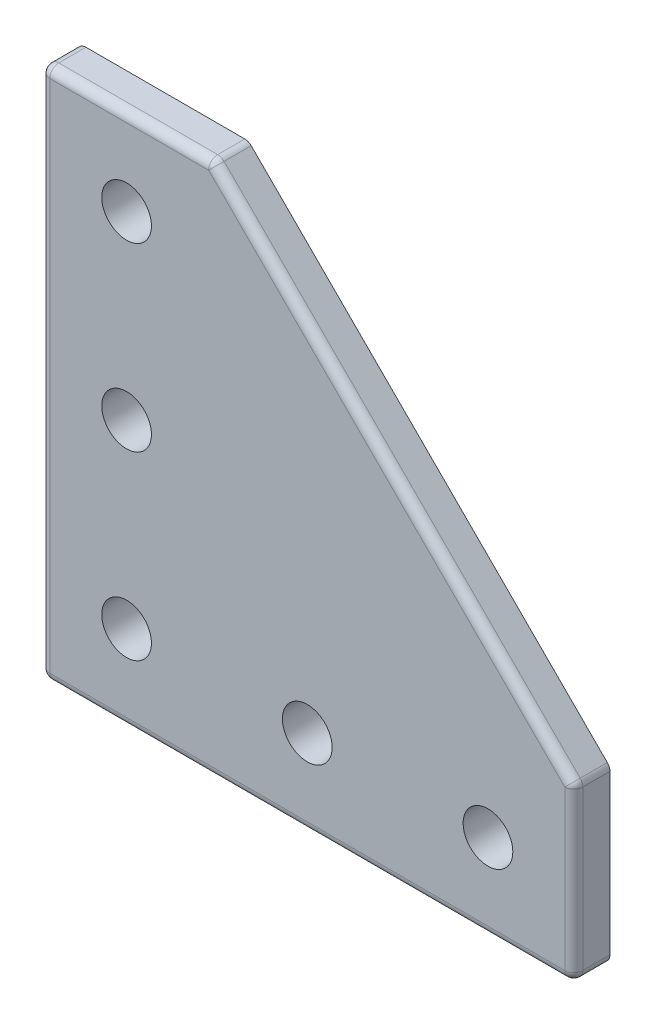
ISO-10303-21;
HEADER;
FILE_DESCRIPTION(('STEP AP214'),'2;1');
FILE_NAME('part.step','',(''),(''),'','','');
FILE_SCHEMA(('AUTOMOTIVE_DESIGN { 1 0 10303 214 1 1 1 1 }'));
ENDSEC;
DATA;
#1=APPLICATION_CONTEXT('core data for automotive mechanical design processes');
#2=APPLICATION_PROTOCOL_DEFINITION('international standard','automotive_design',2000,#1);
#3=PRODUCT_CONTEXT('',#1,'mechanical');
#4=PRODUCT('Part','Part','',(#3));
#5=PRODUCT_RELATED_PRODUCT_CATEGORY('part','',(#4));
#6=PRODUCT_DEFINITION_FORMATION('','',#4);
#7=PRODUCT_DEFINITION_CONTEXT('part definition',#1,'design');
#8=PRODUCT_DEFINITION('design','',#6,#7);
#9=PRODUCT_DEFINITION_SHAPE('','',#8);
#10=(LENGTH_UNIT() NAMED_UNIT(*) SI_UNIT(.MILLI.,.METRE.));
#11=(NAMED_UNIT(*) PLANE_ANGLE_UNIT() SI_UNIT($,.RADIAN.));
#12=(NAMED_UNIT(*) SI_UNIT($,.STERADIAN.) SOLID_ANGLE_UNIT());
#13=UNCERTAINTY_MEASURE_WITH_UNIT(LENGTH_MEASURE(1.E-05),#10,'distance_accuracy_value','');
#14=(GEOMETRIC_REPRESENTATION_CONTEXT(3) GLOBAL_UNCERTAINTY_ASSIGNED_CONTEXT((#13)) GLOBAL_UNIT_ASSIGNED_CONTEXT((#10,
#11,#12)) REPRESENTATION_CONTEXT('',''));
#15=CARTESIAN_POINT('',(0.,0.,0.));
#16=DIRECTION('',(0.,0.,1.));
#17=DIRECTION('',(1.,0.,0.));
#18=AXIS2_PLACEMENT_3D('',#15,#16,#17);
#19=CARTESIAN_POINT('',(0.,0.,2.));
#20=DIRECTION('',(0.,0.,-1.));
#21=DIRECTION('',(-1.,0.,0.));
#22=AXIS2_PLACEMENT_3D('',#19,#20,#21);
#23=PLANE('',#22);
#24=DIRECTION('',(0.,-1.,0.));
#25=VECTOR('',#24,1.);
#26=CARTESIAN_POINT('',(1.,0.,2.));
#27=LINE('',#26,#25);
#28=CARTESIAN_POINT('',(1.,58.,2.));
#29=VERTEX_POINT('',#28);
#30=CARTESIAN_POINT('',(1.,1.,2.));
#31=VERTEX_POINT('',#30);
#32=EDGE_CURVE('E1163',#29,#31,#27,.T.);
#33=ORIENTED_EDGE('',*,*,#32,.T.);
#34=DIRECTION('',(1.,0.,0.));
#35=VECTOR('',#34,1.);
#36=CARTESIAN_POINT('',(0.,1.,2.));
#37=LINE('',#36,#35);
#38=CARTESIAN_POINT('',(58.,0.999999999999998,2.));
#39=VERTEX_POINT('',#38);
#40=EDGE_CURVE('E1170',#31,#39,#37,.T.);
#41=ORIENTED_EDGE('',*,*,#40,.T.);
#42=DIRECTION('',(0.,1.,0.));
#43=VECTOR('',#42,1.);
#44=CARTESIAN_POINT('',(58.,0.,2.));
#45=LINE('',#44,#43);
#46=CARTESIAN_POINT('',(58.,18.5857864376269,2.));
#47=VERTEX_POINT('',#46);
#48=EDGE_CURVE('E1168',#39,#47,#45,.T.);
#49=ORIENTED_EDGE('',*,*,#48,.T.);
#50=DIRECTION('',(-0.707106781186547,0.707106781186548,0.));
#51=VECTOR('',#50,1.);
#52=CARTESIAN_POINT('',(38.2928932188135,38.2928932188134,2.));
#53=LINE('',#52,#51);
#54=CARTESIAN_POINT('',(18.5857864376269,58.,2.));
#55=VERTEX_POINT('',#54);
#56=EDGE_CURVE('E1165',#47,#55,#53,.T.);
#57=ORIENTED_EDGE('',*,*,#56,.T.);
#58=DIRECTION('',(-1.,0.,0.));
#59=VECTOR('',#58,1.);
#60=CARTESIAN_POINT('',(0.,58.,2.));
#61=LINE('',#60,#59);
#62=EDGE_CURVE('E1161',#55,#29,#61,.T.);
#63=ORIENTED_EDGE('',*,*,#62,.T.);
#64=EDGE_LOOP('',(#33,#41,#49,#57,#63));
#65=FACE_BOUND('',#64,.T.);
#66=CARTESIAN_POINT('',(9.5,29.5,2.));
#67=DIRECTION('',(0.,0.,1.));
#68=DIRECTION('',(1.,0.,0.));
#69=AXIS2_PLACEMENT_3D('',#66,#67,#68);
#70=CIRCLE('',#69,2.75000000000001);
#71=CARTESIAN_POINT('',(12.25,29.5,2.));
#72=VERTEX_POINT('',#71);
#73=EDGE_CURVE('E1240',#72,#72,#70,.T.);
#74=ORIENTED_EDGE('',*,*,#73,.F.);
#75=EDGE_LOOP('',(#74));
#76=FACE_BOUND('',#75,.T.);
#77=CARTESIAN_POINT('',(29.5,9.49999999999999,2.));
#78=DIRECTION('',(0.,0.,1.));
#79=DIRECTION('',(1.,0.,0.));
#80=AXIS2_PLACEMENT_3D('',#77,#78,#79);
#81=CIRCLE('',#80,2.75);
#82=CARTESIAN_POINT('',(32.25,9.49999999999999,2.));
#83=VERTEX_POINT('',#82);
#84=EDGE_CURVE('E1252',#83,#83,#81,.T.);
#85=ORIENTED_EDGE('',*,*,#84,.F.);
#86=EDGE_LOOP('',(#85));
#87=FACE_BOUND('',#86,.T.);
#88=CARTESIAN_POINT('',(9.5,9.49999999999999,2.));
#89=DIRECTION('',(0.,0.,1.));
#90=DIRECTION('',(1.,0.,0.));
#91=AXIS2_PLACEMENT_3D('',#88,#89,#90);
#92=CIRCLE('',#91,2.75);
#93=CARTESIAN_POINT('',(12.25,9.49999999999999,2.));
#94=VERTEX_POINT('',#93);
#95=EDGE_CURVE('E1258',#94,#94,#92,.T.);
#96=ORIENTED_EDGE('',*,*,#95,.F.);
#97=EDGE_LOOP('',(#96));
#98=FACE_BOUND('',#97,.T.);
#99=CARTESIAN_POINT('',(49.5,9.49999999999999,2.));
#100=DIRECTION('',(0.,0.,1.));
#101=DIRECTION('',(1.,0.,0.));
#102=AXIS2_PLACEMENT_3D('',#99,#100,#101);
#103=CIRCLE('',#102,2.75000000000001);
#104=CARTESIAN_POINT('',(52.25,9.49999999999999,2.));
#105=VERTEX_POINT('',#104);
#106=EDGE_CURVE('E1246',#105,#105,#103,.T.);
#107=ORIENTED_EDGE('',*,*,#106,.F.);
#108=EDGE_LOOP('',(#107));
#109=FACE_BOUND('',#108,.T.);
#110=CARTESIAN_POINT('',(9.5,49.5,2.));
#111=DIRECTION('',(0.,0.,1.));
#112=DIRECTION('',(1.,0.,0.));
#113=AXIS2_PLACEMENT_3D('',#110,#111,#112);
#114=CIRCLE('',#113,2.75);
#115=CARTESIAN_POINT('',(12.25,49.5,2.));
#116=VERTEX_POINT('',#115);
#117=EDGE_CURVE('E1232',#116,#116,#114,.T.);
#118=ORIENTED_EDGE('',*,*,#117,.F.);
#119=EDGE_LOOP('',(#118));
#120=FACE_BOUND('',#119,.T.);
#121=ADVANCED_FACE('F1020',(#65,#76,#87,#98,#109,#120),#23,.F.);
#122=CARTESIAN_POINT('',(0.,0.,-2.));
#123=DIRECTION('',(0.,0.,-1.));
#124=DIRECTION('',(-1.,0.,0.));
#125=AXIS2_PLACEMENT_3D('',#122,#123,#124);
#126=PLANE('',#125);
#127=CARTESIAN_POINT('',(9.5,29.5,-2.));
#128=DIRECTION('',(0.,0.,1.));
#129=DIRECTION('',(1.,0.,0.));
#130=AXIS2_PLACEMENT_3D('',#127,#128,#129);
#131=CIRCLE('',#130,2.75000000000001);
#132=CARTESIAN_POINT('',(12.25,29.5,-2.));
#133=VERTEX_POINT('',#132);
#134=EDGE_CURVE('E1237',#133,#133,#131,.T.);
#135=ORIENTED_EDGE('',*,*,#134,.T.);
#136=EDGE_LOOP('',(#135));
#137=FACE_BOUND('',#136,.T.);
#138=CARTESIAN_POINT('',(29.5,9.49999999999999,-2.));
#139=DIRECTION('',(0.,0.,1.));
#140=DIRECTION('',(1.,0.,0.));
#141=AXIS2_PLACEMENT_3D('',#138,#139,#140);
#142=CIRCLE('',#141,2.75);
#143=CARTESIAN_POINT('',(32.25,9.49999999999999,-2.));
#144=VERTEX_POINT('',#143);
#145=EDGE_CURVE('E1249',#144,#144,#142,.T.);
#146=ORIENTED_EDGE('',*,*,#145,.T.);
#147=EDGE_LOOP('',(#146));
#148=FACE_BOUND('',#147,.T.);
#149=DIRECTION('',(-0.707106781186547,0.707106781186548,0.));
#150=VECTOR('',#149,1.);
#151=CARTESIAN_POINT('',(19.,59.,-2.));
#152=LINE('',#151,#150);
#153=CARTESIAN_POINT('',(58.7071067811865,19.2928932188134,-2.));
#154=VERTEX_POINT('',#153);
#155=CARTESIAN_POINT('',(19.2928932188135,58.7071067811865,-2.));
#156=VERTEX_POINT('',#155);
#157=EDGE_CURVE('E1126',#154,#156,#152,.T.);
#158=ORIENTED_EDGE('',*,*,#157,.F.);
#159=CARTESIAN_POINT('',(58.,18.5857864376269,-2.));
#160=DIRECTION('',(0.,0.,-1.));
#161=DIRECTION('',(-1.,0.,0.));
#162=AXIS2_PLACEMENT_3D('',#159,#160,#161);
#163=CIRCLE('',#162,1.);
#164=CARTESIAN_POINT('',(59.,18.5857864376269,-2.));
#165=VERTEX_POINT('',#164);
#166=EDGE_CURVE('E1110',#154,#165,#163,.T.);
#167=ORIENTED_EDGE('',*,*,#166,.T.);
#168=DIRECTION('',(0.,1.,0.));
#169=VECTOR('',#168,1.);
#170=CARTESIAN_POINT('',(59.,19.,-2.));
#171=LINE('',#170,#169);
#172=CARTESIAN_POINT('',(59.,0.999999999999997,-2.));
#173=VERTEX_POINT('',#172);
#174=EDGE_CURVE('E1138',#173,#165,#171,.T.);
#175=ORIENTED_EDGE('',*,*,#174,.F.);
#176=CARTESIAN_POINT('',(58.,0.999999999999997,-2.));
#177=DIRECTION('',(0.,0.,-1.));
#178=DIRECTION('',(-1.,0.,0.));
#179=AXIS2_PLACEMENT_3D('',#176,#177,#178);
#180=CIRCLE('',#179,1.);
#181=CARTESIAN_POINT('',(58.,0.,-2.));
#182=VERTEX_POINT('',#181);
#183=EDGE_CURVE('E1152',#173,#182,#180,.T.);
#184=ORIENTED_EDGE('',*,*,#183,.T.);
#185=DIRECTION('',(1.,0.,0.));
#186=VECTOR('',#185,1.);
#187=CARTESIAN_POINT('',(59.,0.,-2.));
#188=LINE('',#187,#186);
#189=CARTESIAN_POINT('',(1.,0.,-2.));
#190=VERTEX_POINT('',#189);
#191=EDGE_CURVE('E1143',#190,#182,#188,.T.);
#192=ORIENTED_EDGE('',*,*,#191,.F.);
#193=CARTESIAN_POINT('',(1.,1.,-2.));
#194=DIRECTION('',(0.,0.,-1.));
#195=DIRECTION('',(-1.,0.,0.));
#196=AXIS2_PLACEMENT_3D('',#193,#194,#195);
#197=CIRCLE('',#196,1.);
#198=CARTESIAN_POINT('',(0.,1.,-2.));
#199=VERTEX_POINT('',#198);
#200=EDGE_CURVE('E1154',#190,#199,#197,.T.);
#201=ORIENTED_EDGE('',*,*,#200,.T.);
#202=DIRECTION('',(0.,-1.,0.));
#203=VECTOR('',#202,1.);
#204=CARTESIAN_POINT('',(0.,0.,-2.));
#205=LINE('',#204,#203);
#206=CARTESIAN_POINT('',(0.,58.,-2.));
#207=VERTEX_POINT('',#206);
#208=EDGE_CURVE('E1141',#207,#199,#205,.T.);
#209=ORIENTED_EDGE('',*,*,#208,.F.);
#210=CARTESIAN_POINT('',(1.,58.,-2.));
#211=DIRECTION('',(0.,0.,-1.));
#212=DIRECTION('',(-1.,0.,0.));
#213=AXIS2_PLACEMENT_3D('',#210,#211,#212);
#214=CIRCLE('',#213,1.);
#215=CARTESIAN_POINT('',(1.,59.,-2.));
#216=VERTEX_POINT('',#215);
#217=EDGE_CURVE('E1131',#207,#216,#214,.T.);
#218=ORIENTED_EDGE('',*,*,#217,.T.);
#219=DIRECTION('',(-1.,0.,0.));
#220=VECTOR('',#219,1.);
#221=CARTESIAN_POINT('',(19.,59.,-2.));
#222=LINE('',#221,#220);
#223=CARTESIAN_POINT('',(18.5857864376269,59.,-2.));
#224=VERTEX_POINT('',#223);
#225=EDGE_CURVE('E1137',#224,#216,#222,.T.);
#226=ORIENTED_EDGE('',*,*,#225,.F.);
#227=CARTESIAN_POINT('',(18.5857864376269,58.,-2.));
#228=DIRECTION('',(0.,0.,-1.));
#229=DIRECTION('',(-1.,0.,0.));
#230=AXIS2_PLACEMENT_3D('',#227,#228,#229);
#231=CIRCLE('',#230,1.);
#232=EDGE_CURVE('E1121',#224,#156,#231,.T.);
#233=ORIENTED_EDGE('',*,*,#232,.T.);
#234=EDGE_LOOP('',(#158,#167,#175,#184,#192,#201,#209,#218,#226,#233));
#235=FACE_BOUND('',#234,.T.);
#236=CARTESIAN_POINT('',(9.5,9.49999999999999,-2.));
#237=DIRECTION('',(0.,0.,1.));
#238=DIRECTION('',(1.,0.,0.));
#239=AXIS2_PLACEMENT_3D('',#236,#237,#238);
#240=CIRCLE('',#239,2.75);
#241=CARTESIAN_POINT('',(12.25,9.49999999999999,-2.));
#242=VERTEX_POINT('',#241);
#243=EDGE_CURVE('E1255',#242,#242,#240,.T.);
#244=ORIENTED_EDGE('',*,*,#243,.T.);
#245=EDGE_LOOP('',(#244));
#246=FACE_BOUND('',#245,.T.);
#247=CARTESIAN_POINT('',(49.5,9.49999999999999,-2.));
#248=DIRECTION('',(0.,0.,1.));
#249=DIRECTION('',(1.,0.,0.));
#250=AXIS2_PLACEMENT_3D('',#247,#248,#249);
#251=CIRCLE('',#250,2.75000000000001);
#252=CARTESIAN_POINT('',(52.25,9.49999999999999,-2.));
#253=VERTEX_POINT('',#252);
#254=EDGE_CURVE('E1243',#253,#253,#251,.T.);
#255=ORIENTED_EDGE('',*,*,#254,.T.);
#256=EDGE_LOOP('',(#255));
#257=FACE_BOUND('',#256,.T.);
#258=CARTESIAN_POINT('',(9.5,49.5,-2.));
#259=DIRECTION('',(0.,0.,1.));
#260=DIRECTION('',(1.,0.,0.));
#261=AXIS2_PLACEMENT_3D('',#258,#259,#260);
#262=CIRCLE('',#261,2.75);
#263=CARTESIAN_POINT('',(12.25,49.5,-2.));
#264=VERTEX_POINT('',#263);
#265=EDGE_CURVE('E1229',#264,#264,#262,.T.);
#266=ORIENTED_EDGE('',*,*,#265,.T.);
#267=EDGE_LOOP('',(#266));
#268=FACE_BOUND('',#267,.T.);
#269=ADVANCED_FACE('F1133',(#137,#148,#235,#246,#257,#268),#126,.T.);
#270=CARTESIAN_POINT('',(59.,0.,2.));
#271=DIRECTION('',(0.,1.,0.));
#272=DIRECTION('',(-1.,0.,0.));
#273=AXIS2_PLACEMENT_3D('',#270,#271,#272);
#274=PLANE('',#273);
#275=DIRECTION('',(1.,0.,0.));
#276=VECTOR('',#275,1.);
#277=CARTESIAN_POINT('',(59.,0.,1.));
#278=LINE('',#277,#276);
#279=CARTESIAN_POINT('',(58.,0.,1.));
#280=VERTEX_POINT('',#279);
#281=CARTESIAN_POINT('',(1.,0.,1.));
#282=VERTEX_POINT('',#281);
#283=EDGE_CURVE('E1180',#280,#282,#278,.F.);
#284=ORIENTED_EDGE('',*,*,#283,.T.);
#285=DIRECTION('',(0.,0.,-1.));
#286=VECTOR('',#285,1.);
#287=CARTESIAN_POINT('',(1.,0.,2.));
#288=LINE('',#287,#286);
#289=EDGE_CURVE('E1182',#282,#190,#288,.T.);
#290=ORIENTED_EDGE('',*,*,#289,.T.);
#291=ORIENTED_EDGE('',*,*,#191,.T.);
#292=DIRECTION('',(0.,0.,-1.));
#293=VECTOR('',#292,1.);
#294=CARTESIAN_POINT('',(58.,0.,2.));
#295=LINE('',#294,#293);
#296=EDGE_CURVE('E1178',#182,#280,#295,.F.);
#297=ORIENTED_EDGE('',*,*,#296,.T.);
#298=EDGE_LOOP('',(#284,#290,#291,#297));
#299=FACE_BOUND('',#298,.T.);
#300=ADVANCED_FACE('F1266',(#299),#274,.F.);
#301=CARTESIAN_POINT('',(59.,19.,2.));
#302=DIRECTION('',(-1.,0.,0.));
#303=DIRECTION('',(0.,0.,1.));
#304=AXIS2_PLACEMENT_3D('',#301,#302,#303);
#305=PLANE('',#304);
#306=ORIENTED_EDGE('',*,*,#174,.T.);
#307=DIRECTION('',(0.,0.,-1.));
#308=VECTOR('',#307,1.);
#309=CARTESIAN_POINT('',(59.,18.5857864376269,2.));
#310=LINE('',#309,#308);
#311=CARTESIAN_POINT('',(59.,18.5857864376269,1.));
#312=VERTEX_POINT('',#311);
#313=EDGE_CURVE('E1115',#165,#312,#310,.F.);
#314=ORIENTED_EDGE('',*,*,#313,.T.);
#315=DIRECTION('',(0.,1.,0.));
#316=VECTOR('',#315,1.);
#317=CARTESIAN_POINT('',(59.,19.,1.));
#318=LINE('',#317,#316);
#319=CARTESIAN_POINT('',(59.,0.999999999999997,1.));
#320=VERTEX_POINT('',#319);
#321=EDGE_CURVE('E1158',#312,#320,#318,.F.);
#322=ORIENTED_EDGE('',*,*,#321,.T.);
#323=DIRECTION('',(0.,0.,-1.));
#324=VECTOR('',#323,1.);
#325=CARTESIAN_POINT('',(59.,0.999999999999997,2.));
#326=LINE('',#325,#324);
#327=EDGE_CURVE('E1120',#320,#173,#326,.T.);
#328=ORIENTED_EDGE('',*,*,#327,.T.);
#329=EDGE_LOOP('',(#306,#314,#322,#328));
#330=FACE_BOUND('',#329,.T.);
#331=ADVANCED_FACE('F1323',(#330),#305,.F.);
#332=CARTESIAN_POINT('',(19.,59.,2.));
#333=DIRECTION('',(-0.707106781186548,-0.707106781186547,0.));
#334=DIRECTION('',(0.707106781186547,-0.707106781186548,0.));
#335=AXIS2_PLACEMENT_3D('',#332,#333,#334);
#336=PLANE('',#335);
#337=DIRECTION('',(-0.707106781186547,0.707106781186548,0.));
#338=VECTOR('',#337,1.);
#339=CARTESIAN_POINT('',(19.,59.,1.));
#340=LINE('',#339,#338);
#341=CARTESIAN_POINT('',(19.2928932188135,58.7071067811865,1.));
#342=VERTEX_POINT('',#341);
#343=CARTESIAN_POINT('',(58.7071067811865,19.2928932188134,1.));
#344=VERTEX_POINT('',#343);
#345=EDGE_CURVE('E1129',#342,#344,#340,.F.);
#346=ORIENTED_EDGE('',*,*,#345,.T.);
#347=DIRECTION('',(0.,0.,-1.));
#348=VECTOR('',#347,1.);
#349=CARTESIAN_POINT('',(58.7071067811865,19.2928932188134,2.));
#350=LINE('',#349,#348);
#351=EDGE_CURVE('E1114',#344,#154,#350,.T.);
#352=ORIENTED_EDGE('',*,*,#351,.T.);
#353=ORIENTED_EDGE('',*,*,#157,.T.);
#354=DIRECTION('',(0.,0.,-1.));
#355=VECTOR('',#354,1.);
#356=CARTESIAN_POINT('',(19.2928932188135,58.7071067811865,2.));
#357=LINE('',#356,#355);
#358=EDGE_CURVE('E1148',#156,#342,#357,.F.);
#359=ORIENTED_EDGE('',*,*,#358,.T.);
#360=EDGE_LOOP('',(#346,#352,#353,#359));
#361=FACE_BOUND('',#360,.T.);
#362=ADVANCED_FACE('F1125',(#361),#336,.F.);
#363=CARTESIAN_POINT('',(19.,59.,2.));
#364=DIRECTION('',(0.,-1.,0.));
#365=DIRECTION('',(0.,0.,-1.));
#366=AXIS2_PLACEMENT_3D('',#363,#364,#365);
#367=PLANE('',#366);
#368=DIRECTION('',(-1.,0.,0.));
#369=VECTOR('',#368,1.);
#370=CARTESIAN_POINT('',(19.,59.,1.));
#371=LINE('',#370,#369);
#372=CARTESIAN_POINT('',(1.,59.,1.));
#373=VERTEX_POINT('',#372);
#374=CARTESIAN_POINT('',(18.5857864376269,59.,1.));
#375=VERTEX_POINT('',#374);
#376=EDGE_CURVE('E1174',#373,#375,#371,.F.);
#377=ORIENTED_EDGE('',*,*,#376,.T.);
#378=DIRECTION('',(0.,0.,-1.));
#379=VECTOR('',#378,1.);
#380=CARTESIAN_POINT('',(18.5857864376269,59.,2.));
#381=LINE('',#380,#379);
#382=EDGE_CURVE('E1176',#375,#224,#381,.T.);
#383=ORIENTED_EDGE('',*,*,#382,.T.);
#384=ORIENTED_EDGE('',*,*,#225,.T.);
#385=DIRECTION('',(0.,0.,-1.));
#386=VECTOR('',#385,1.);
#387=CARTESIAN_POINT('',(1.,59.,2.));
#388=LINE('',#387,#386);
#389=EDGE_CURVE('E1172',#216,#373,#388,.F.);
#390=ORIENTED_EDGE('',*,*,#389,.T.);
#391=EDGE_LOOP('',(#377,#383,#384,#390));
#392=FACE_BOUND('',#391,.T.);
#393=ADVANCED_FACE('F1305',(#392),#367,.F.);
#394=CARTESIAN_POINT('',(0.,0.,2.));
#395=DIRECTION('',(1.,0.,0.));
#396=DIRECTION('',(0.,0.,-1.));
#397=AXIS2_PLACEMENT_3D('',#394,#395,#396);
#398=PLANE('',#397);
#399=ORIENTED_EDGE('',*,*,#208,.T.);
#400=DIRECTION('',(0.,0.,-1.));
#401=VECTOR('',#400,1.);
#402=CARTESIAN_POINT('',(0.,1.,2.));
#403=LINE('',#402,#401);
#404=CARTESIAN_POINT('',(0.,1.,1.));
#405=VERTEX_POINT('',#404);
#406=EDGE_CURVE('E12',#199,#405,#403,.F.);
#407=ORIENTED_EDGE('',*,*,#406,.T.);
#408=DIRECTION('',(0.,-1.,0.));
#409=VECTOR('',#408,1.);
#410=CARTESIAN_POINT('',(0.,0.,1.));
#411=LINE('',#410,#409);
#412=CARTESIAN_POINT('',(0.,58.,1.));
#413=VERTEX_POINT('',#412);
#414=EDGE_CURVE('E1029',#405,#413,#411,.F.);
#415=ORIENTED_EDGE('',*,*,#414,.T.);
#416=DIRECTION('',(0.,0.,-1.));
#417=VECTOR('',#416,1.);
#418=CARTESIAN_POINT('',(0.,58.,2.));
#419=LINE('',#418,#417);
#420=EDGE_CURVE('E1184',#413,#207,#419,.T.);
#421=ORIENTED_EDGE('',*,*,#420,.T.);
#422=EDGE_LOOP('',(#399,#407,#415,#421));
#423=FACE_BOUND('',#422,.T.);
#424=ADVANCED_FACE('F1286',(#423),#398,.F.);
#425=CARTESIAN_POINT('',(9.5,9.49999999999999,2.));
#426=DIRECTION('',(0.,0.,-1.));
#427=DIRECTION('',(-1.,0.,0.));
#428=AXIS2_PLACEMENT_3D('',#425,#426,#427);
#429=CYLINDRICAL_SURFACE('',#428,2.75);
#430=ORIENTED_EDGE('',*,*,#95,.T.);
#431=EDGE_LOOP('',(#430));
#432=FACE_BOUND('',#431,.T.);
#433=ORIENTED_EDGE('',*,*,#243,.F.);
#434=EDGE_LOOP('',(#433));
#435=FACE_BOUND('',#434,.T.);
#436=ADVANCED_FACE('F1342',(#432,#435),#429,.F.);
#437=CARTESIAN_POINT('',(29.5,9.49999999999999,2.));
#438=DIRECTION('',(0.,0.,-1.));
#439=DIRECTION('',(-1.,0.,0.));
#440=AXIS2_PLACEMENT_3D('',#437,#438,#439);
#441=CYLINDRICAL_SURFACE('',#440,2.75);
#442=ORIENTED_EDGE('',*,*,#84,.T.);
#443=EDGE_LOOP('',(#442));
#444=FACE_BOUND('',#443,.T.);
#445=ORIENTED_EDGE('',*,*,#145,.F.);
#446=EDGE_LOOP('',(#445));
#447=FACE_BOUND('',#446,.T.);
#448=ADVANCED_FACE('F1363',(#444,#447),#441,.F.);
#449=CARTESIAN_POINT('',(49.5,9.49999999999999,2.));
#450=DIRECTION('',(0.,0.,-1.));
#451=DIRECTION('',(-1.,0.,0.));
#452=AXIS2_PLACEMENT_3D('',#449,#450,#451);
#453=CYLINDRICAL_SURFACE('',#452,2.75000000000001);
#454=ORIENTED_EDGE('',*,*,#106,.T.);
#455=EDGE_LOOP('',(#454));
#456=FACE_BOUND('',#455,.T.);
#457=ORIENTED_EDGE('',*,*,#254,.F.);
#458=EDGE_LOOP('',(#457));
#459=FACE_BOUND('',#458,.T.);
#460=ADVANCED_FACE('F1370',(#456,#459),#453,.F.);
#461=CARTESIAN_POINT('',(9.5,29.5,2.));
#462=DIRECTION('',(0.,0.,-1.));
#463=DIRECTION('',(-1.,0.,0.));
#464=AXIS2_PLACEMENT_3D('',#461,#462,#463);
#465=CYLINDRICAL_SURFACE('',#464,2.75000000000001);
#466=ORIENTED_EDGE('',*,*,#73,.T.);
#467=EDGE_LOOP('',(#466));
#468=FACE_BOUND('',#467,.T.);
#469=ORIENTED_EDGE('',*,*,#134,.F.);
#470=EDGE_LOOP('',(#469));
#471=FACE_BOUND('',#470,.T.);
#472=ADVANCED_FACE('F1377',(#468,#471),#465,.F.);
#473=CARTESIAN_POINT('',(9.5,49.5,2.));
#474=DIRECTION('',(0.,0.,-1.));
#475=DIRECTION('',(-1.,0.,0.));
#476=AXIS2_PLACEMENT_3D('',#473,#474,#475);
#477=CYLINDRICAL_SURFACE('',#476,2.75);
#478=ORIENTED_EDGE('',*,*,#117,.T.);
#479=EDGE_LOOP('',(#478));
#480=FACE_BOUND('',#479,.T.);
#481=ORIENTED_EDGE('',*,*,#265,.F.);
#482=EDGE_LOOP('',(#481));
#483=FACE_BOUND('',#482,.T.);
#484=ADVANCED_FACE('F1385',(#480,#483),#477,.F.);
#485=CARTESIAN_POINT('',(1.,1.,2.));
#486=DIRECTION('',(0.,0.,-1.));
#487=DIRECTION('',(-1.,0.,0.));
#488=AXIS2_PLACEMENT_3D('',#485,#486,#487);
#489=CYLINDRICAL_SURFACE('',#488,1.);
#490=ORIENTED_EDGE('',*,*,#200,.F.);
#491=ORIENTED_EDGE('',*,*,#289,.F.);
#492=CARTESIAN_POINT('',(1.,1.,1.));
#493=DIRECTION('',(0.,0.,1.));
#494=DIRECTION('',(1.,0.,0.));
#495=AXIS2_PLACEMENT_3D('',#492,#493,#494);
#496=CIRCLE('',#495,1.);
#497=EDGE_CURVE('E1024',#405,#282,#496,.T.);
#498=ORIENTED_EDGE('',*,*,#497,.F.);
#499=ORIENTED_EDGE('',*,*,#406,.F.);
#500=EDGE_LOOP('',(#490,#491,#498,#499));
#501=FACE_BOUND('',#500,.T.);
#502=ADVANCED_FACE('F1022',(#501),#489,.T.);
#503=CARTESIAN_POINT('',(1.,0.,1.));
#504=DIRECTION('',(0.,-1.,0.));
#505=DIRECTION('',(0.,0.,-1.));
#506=AXIS2_PLACEMENT_3D('',#503,#504,#505);
#507=CYLINDRICAL_SURFACE('',#506,1.);
#508=CARTESIAN_POINT('',(1.,58.,1.));
#509=DIRECTION('',(0.,1.,0.));
#510=DIRECTION('',(0.,0.,1.));
#511=AXIS2_PLACEMENT_3D('',#508,#509,#510);
#512=CIRCLE('',#511,1.);
#513=EDGE_CURVE('E1221',#413,#29,#512,.T.);
#514=ORIENTED_EDGE('',*,*,#513,.F.);
#515=ORIENTED_EDGE('',*,*,#414,.F.);
#516=CARTESIAN_POINT('',(1.,1.,1.));
#517=DIRECTION('',(0.,-1.,0.));
#518=DIRECTION('',(0.,0.,-1.));
#519=AXIS2_PLACEMENT_3D('',#516,#517,#518);
#520=CIRCLE('',#519,1.);
#521=EDGE_CURVE('E1223',#31,#405,#520,.T.);
#522=ORIENTED_EDGE('',*,*,#521,.F.);
#523=ORIENTED_EDGE('',*,*,#32,.F.);
#524=EDGE_LOOP('',(#514,#515,#522,#523));
#525=FACE_BOUND('',#524,.T.);
#526=ADVANCED_FACE('F1295',(#525),#507,.T.);
#527=CARTESIAN_POINT('',(1.,58.,2.));
#528=DIRECTION('',(0.,0.,-1.));
#529=DIRECTION('',(-1.,0.,0.));
#530=AXIS2_PLACEMENT_3D('',#527,#528,#529);
#531=CYLINDRICAL_SURFACE('',#530,1.);
#532=ORIENTED_EDGE('',*,*,#217,.F.);
#533=ORIENTED_EDGE('',*,*,#420,.F.);
#534=CARTESIAN_POINT('',(1.,58.,1.));
#535=DIRECTION('',(0.,0.,1.));
#536=DIRECTION('',(1.,0.,0.));
#537=AXIS2_PLACEMENT_3D('',#534,#535,#536);
#538=CIRCLE('',#537,1.);
#539=EDGE_CURVE('E1218',#373,#413,#538,.T.);
#540=ORIENTED_EDGE('',*,*,#539,.F.);
#541=ORIENTED_EDGE('',*,*,#389,.F.);
#542=EDGE_LOOP('',(#532,#533,#540,#541));
#543=FACE_BOUND('',#542,.T.);
#544=ADVANCED_FACE('F1290',(#543),#531,.T.);
#545=CARTESIAN_POINT('',(1.,1.,1.));
#546=DIRECTION('',(0.,0.,1.));
#547=DIRECTION('',(1.,0.,0.));
#548=AXIS2_PLACEMENT_3D('',#545,#546,#547);
#549=SPHERICAL_SURFACE('',#548,1.);
#550=ORIENTED_EDGE('',*,*,#521,.T.);
#551=ORIENTED_EDGE('',*,*,#497,.T.);
#552=CARTESIAN_POINT('',(1.,1.,1.));
#553=DIRECTION('',(-1.,0.,0.));
#554=DIRECTION('',(0.,0.,1.));
#555=AXIS2_PLACEMENT_3D('',#552,#553,#554);
#556=CIRCLE('',#555,1.);
#557=EDGE_CURVE('E1215',#31,#282,#556,.F.);
#558=ORIENTED_EDGE('',*,*,#557,.F.);
#559=EDGE_LOOP('',(#550,#551,#558));
#560=FACE_BOUND('',#559,.T.);
#561=ADVANCED_FACE('F1409',(#560),#549,.T.);
#562=CARTESIAN_POINT('',(1.,58.,1.));
#563=DIRECTION('',(0.,0.,1.));
#564=DIRECTION('',(1.,0.,0.));
#565=AXIS2_PLACEMENT_3D('',#562,#563,#564);
#566=SPHERICAL_SURFACE('',#565,1.);
#567=ORIENTED_EDGE('',*,*,#539,.T.);
#568=ORIENTED_EDGE('',*,*,#513,.T.);
#569=CARTESIAN_POINT('',(1.,58.,1.));
#570=DIRECTION('',(-1.,0.,0.));
#571=DIRECTION('',(0.,0.,1.));
#572=AXIS2_PLACEMENT_3D('',#569,#570,#571);
#573=CIRCLE('',#572,1.);
#574=EDGE_CURVE('E1212',#373,#29,#573,.F.);
#575=ORIENTED_EDGE('',*,*,#574,.F.);
#576=EDGE_LOOP('',(#567,#568,#575));
#577=FACE_BOUND('',#576,.T.);
#578=ADVANCED_FACE('F1297',(#577),#566,.T.);
#579=CARTESIAN_POINT('',(58.,0.999999999999997,2.));
#580=DIRECTION('',(0.,0.,-1.));
#581=DIRECTION('',(-1.,0.,0.));
#582=AXIS2_PLACEMENT_3D('',#579,#580,#581);
#583=CYLINDRICAL_SURFACE('',#582,1.);
#584=ORIENTED_EDGE('',*,*,#183,.F.);
#585=ORIENTED_EDGE('',*,*,#327,.F.);
#586=CARTESIAN_POINT('',(58.,0.999999999999998,1.));
#587=DIRECTION('',(0.,0.,1.));
#588=DIRECTION('',(1.,0.,0.));
#589=AXIS2_PLACEMENT_3D('',#586,#587,#588);
#590=CIRCLE('',#589,1.);
#591=EDGE_CURVE('E1209',#280,#320,#590,.T.);
#592=ORIENTED_EDGE('',*,*,#591,.F.);
#593=ORIENTED_EDGE('',*,*,#296,.F.);
#594=EDGE_LOOP('',(#584,#585,#592,#593));
#595=FACE_BOUND('',#594,.T.);
#596=ADVANCED_FACE('F1273',(#595),#583,.T.);
#597=CARTESIAN_POINT('',(0.,1.,1.));
#598=DIRECTION('',(1.,0.,0.));
#599=DIRECTION('',(0.,1.,0.));
#600=AXIS2_PLACEMENT_3D('',#597,#598,#599);
#601=CYLINDRICAL_SURFACE('',#600,1.);
#602=ORIENTED_EDGE('',*,*,#557,.T.);
#603=ORIENTED_EDGE('',*,*,#283,.F.);
#604=CARTESIAN_POINT('',(58.,0.999999999999998,1.));
#605=DIRECTION('',(1.,0.,0.));
#606=DIRECTION('',(0.,0.,-1.));
#607=AXIS2_PLACEMENT_3D('',#604,#605,#606);
#608=CIRCLE('',#607,1.);
#609=EDGE_CURVE('E1206',#39,#280,#608,.T.);
#610=ORIENTED_EDGE('',*,*,#609,.F.);
#611=ORIENTED_EDGE('',*,*,#40,.F.);
#612=EDGE_LOOP('',(#602,#603,#610,#611));
#613=FACE_BOUND('',#612,.T.);
#614=ADVANCED_FACE('F1282',(#613),#601,.T.);
#615=CARTESIAN_POINT('',(0.,58.,1.));
#616=DIRECTION('',(-1.,0.,0.));
#617=DIRECTION('',(0.,0.,1.));
#618=AXIS2_PLACEMENT_3D('',#615,#616,#617);
#619=CYLINDRICAL_SURFACE('',#618,1.);
#620=ORIENTED_EDGE('',*,*,#574,.T.);
#621=ORIENTED_EDGE('',*,*,#62,.F.);
#622=CARTESIAN_POINT('',(18.5857864376269,58.,1.));
#623=DIRECTION('',(1.,0.,0.));
#624=DIRECTION('',(0.,0.,-1.));
#625=AXIS2_PLACEMENT_3D('',#622,#623,#624);
#626=CIRCLE('',#625,1.);
#627=EDGE_CURVE('E1203',#375,#55,#626,.T.);
#628=ORIENTED_EDGE('',*,*,#627,.F.);
#629=ORIENTED_EDGE('',*,*,#376,.F.);
#630=EDGE_LOOP('',(#620,#621,#628,#629));
#631=FACE_BOUND('',#630,.T.);
#632=ADVANCED_FACE('F1302',(#631),#619,.T.);
#633=CARTESIAN_POINT('',(18.5857864376269,58.,2.));
#634=DIRECTION('',(0.,0.,-1.));
#635=DIRECTION('',(-1.,0.,0.));
#636=AXIS2_PLACEMENT_3D('',#633,#634,#635);
#637=CYLINDRICAL_SURFACE('',#636,1.);
#638=ORIENTED_EDGE('',*,*,#232,.F.);
#639=ORIENTED_EDGE('',*,*,#382,.F.);
#640=CARTESIAN_POINT('',(18.5857864376269,58.,1.));
#641=DIRECTION('',(0.,0.,1.));
#642=DIRECTION('',(1.,0.,0.));
#643=AXIS2_PLACEMENT_3D('',#640,#641,#642);
#644=CIRCLE('',#643,1.);
#645=EDGE_CURVE('E1200',#342,#375,#644,.T.);
#646=ORIENTED_EDGE('',*,*,#645,.F.);
#647=ORIENTED_EDGE('',*,*,#358,.F.);
#648=EDGE_LOOP('',(#638,#639,#646,#647));
#649=FACE_BOUND('',#648,.T.);
#650=ADVANCED_FACE('F1308',(#649),#637,.T.);
#651=CARTESIAN_POINT('',(58.,0.999999999999998,1.));
#652=DIRECTION('',(0.,0.,1.));
#653=DIRECTION('',(1.,0.,0.));
#654=AXIS2_PLACEMENT_3D('',#651,#652,#653);
#655=SPHERICAL_SURFACE('',#654,1.);
#656=ORIENTED_EDGE('',*,*,#609,.T.);
#657=ORIENTED_EDGE('',*,*,#591,.T.);
#658=CARTESIAN_POINT('',(58.,0.999999999999997,1.));
#659=DIRECTION('',(0.,-1.,0.));
#660=DIRECTION('',(0.,0.,-1.));
#661=AXIS2_PLACEMENT_3D('',#658,#659,#660);
#662=CIRCLE('',#661,1.);
#663=EDGE_CURVE('E1197',#39,#320,#662,.F.);
#664=ORIENTED_EDGE('',*,*,#663,.F.);
#665=EDGE_LOOP('',(#656,#657,#664));
#666=FACE_BOUND('',#665,.T.);
#667=ADVANCED_FACE('F1278',(#666),#655,.T.);
#668=CARTESIAN_POINT('',(18.5857864376269,58.,1.));
#669=DIRECTION('',(0.,0.,1.));
#670=DIRECTION('',(1.,0.,0.));
#671=AXIS2_PLACEMENT_3D('',#668,#669,#670);
#672=SPHERICAL_SURFACE('',#671,1.);
#673=ORIENTED_EDGE('',*,*,#645,.T.);
#674=ORIENTED_EDGE('',*,*,#627,.T.);
#675=CARTESIAN_POINT('',(18.5857864376269,58.,1.));
#676=DIRECTION('',(-0.707106781186553,0.707106781186542,0.));
#677=DIRECTION('',(-0.707106781186542,-0.707106781186553,0.));
#678=AXIS2_PLACEMENT_3D('',#675,#676,#677);
#679=CIRCLE('',#678,1.);
#680=EDGE_CURVE('E1195',#342,#55,#679,.F.);
#681=ORIENTED_EDGE('',*,*,#680,.F.);
#682=EDGE_LOOP('',(#673,#674,#681));
#683=FACE_BOUND('',#682,.T.);
#684=ADVANCED_FACE('F1311',(#683),#672,.T.);
#685=CARTESIAN_POINT('',(58.,0.,1.));
#686=DIRECTION('',(0.,1.,0.));
#687=DIRECTION('',(0.,0.,1.));
#688=AXIS2_PLACEMENT_3D('',#685,#686,#687);
#689=CYLINDRICAL_SURFACE('',#688,1.);
#690=ORIENTED_EDGE('',*,*,#663,.T.);
#691=ORIENTED_EDGE('',*,*,#321,.F.);
#692=CARTESIAN_POINT('',(58.,18.5857864376269,1.));
#693=DIRECTION('',(0.,1.,0.));
#694=DIRECTION('',(-1.,0.,0.));
#695=AXIS2_PLACEMENT_3D('',#692,#693,#694);
#696=CIRCLE('',#695,1.);
#697=EDGE_CURVE('E1192',#47,#312,#696,.T.);
#698=ORIENTED_EDGE('',*,*,#697,.F.);
#699=ORIENTED_EDGE('',*,*,#48,.F.);
#700=EDGE_LOOP('',(#690,#691,#698,#699));
#701=FACE_BOUND('',#700,.T.);
#702=ADVANCED_FACE('F1321',(#701),#689,.T.);
#703=CARTESIAN_POINT('',(38.2928932188135,38.2928932188134,1.));
#704=DIRECTION('',(-0.707106781186547,0.707106781186548,0.));
#705=DIRECTION('',(-0.707106781186548,-0.707106781186547,0.));
#706=AXIS2_PLACEMENT_3D('',#703,#704,#705);
#707=CYLINDRICAL_SURFACE('',#706,1.);
#708=ORIENTED_EDGE('',*,*,#680,.T.);
#709=ORIENTED_EDGE('',*,*,#56,.F.);
#710=CARTESIAN_POINT('',(58.,18.5857864376269,1.));
#711=DIRECTION('',(0.707106781186549,-0.707106781186546,0.));
#712=DIRECTION('',(0.707106781186546,0.707106781186549,0.));
#713=AXIS2_PLACEMENT_3D('',#710,#711,#712);
#714=CIRCLE('',#713,1.);
#715=EDGE_CURVE('E1189',#344,#47,#714,.T.);
#716=ORIENTED_EDGE('',*,*,#715,.F.);
#717=ORIENTED_EDGE('',*,*,#345,.F.);
#718=EDGE_LOOP('',(#708,#709,#716,#717));
#719=FACE_BOUND('',#718,.T.);
#720=ADVANCED_FACE('F1314',(#719),#707,.T.);
#721=CARTESIAN_POINT('',(58.,18.5857864376269,1.));
#722=DIRECTION('',(0.,0.,1.));
#723=DIRECTION('',(1.,0.,0.));
#724=AXIS2_PLACEMENT_3D('',#721,#722,#723);
#725=SPHERICAL_SURFACE('',#724,1.);
#726=ORIENTED_EDGE('',*,*,#715,.T.);
#727=ORIENTED_EDGE('',*,*,#697,.T.);
#728=CARTESIAN_POINT('',(58.,18.5857864376269,1.));
#729=DIRECTION('',(0.,0.,1.));
#730=DIRECTION('',(1.,0.,0.));
#731=AXIS2_PLACEMENT_3D('',#728,#729,#730);
#732=CIRCLE('',#731,1.);
#733=EDGE_CURVE('E1187',#344,#312,#732,.F.);
#734=ORIENTED_EDGE('',*,*,#733,.F.);
#735=EDGE_LOOP('',(#726,#727,#734));
#736=FACE_BOUND('',#735,.T.);
#737=ADVANCED_FACE('F1318',(#736),#725,.T.);
#738=CARTESIAN_POINT('',(58.,18.5857864376269,2.));
#739=DIRECTION('',(0.,0.,-1.));
#740=DIRECTION('',(-1.,0.,0.));
#741=AXIS2_PLACEMENT_3D('',#738,#739,#740);
#742=CYLINDRICAL_SURFACE('',#741,1.);
#743=ORIENTED_EDGE('',*,*,#733,.T.);
#744=ORIENTED_EDGE('',*,*,#313,.F.);
#745=ORIENTED_EDGE('',*,*,#166,.F.);
#746=ORIENTED_EDGE('',*,*,#351,.F.);
#747=EDGE_LOOP('',(#743,#744,#745,#746));
#748=FACE_BOUND('',#747,.T.);
#749=ADVANCED_FACE('F1113',(#748),#742,.T.);
#750=CLOSED_SHELL('',(#121,#269,#300,#331,#362,#393,#424,#436,#448,#460,#472,#484,#502,#526,
#544,#561,#578,#596,#614,#632,#650,#667,#684,#702,#720,#737,#749));
#751=MANIFOLD_SOLID_BREP('B2',#750);
#752=ADVANCED_BREP_SHAPE_REPRESENTATION('',(#18,#751),#14);
#753=SHAPE_DEFINITION_REPRESENTATION(#9,#752);
ENDSEC;
END-ISO-10303-21;
